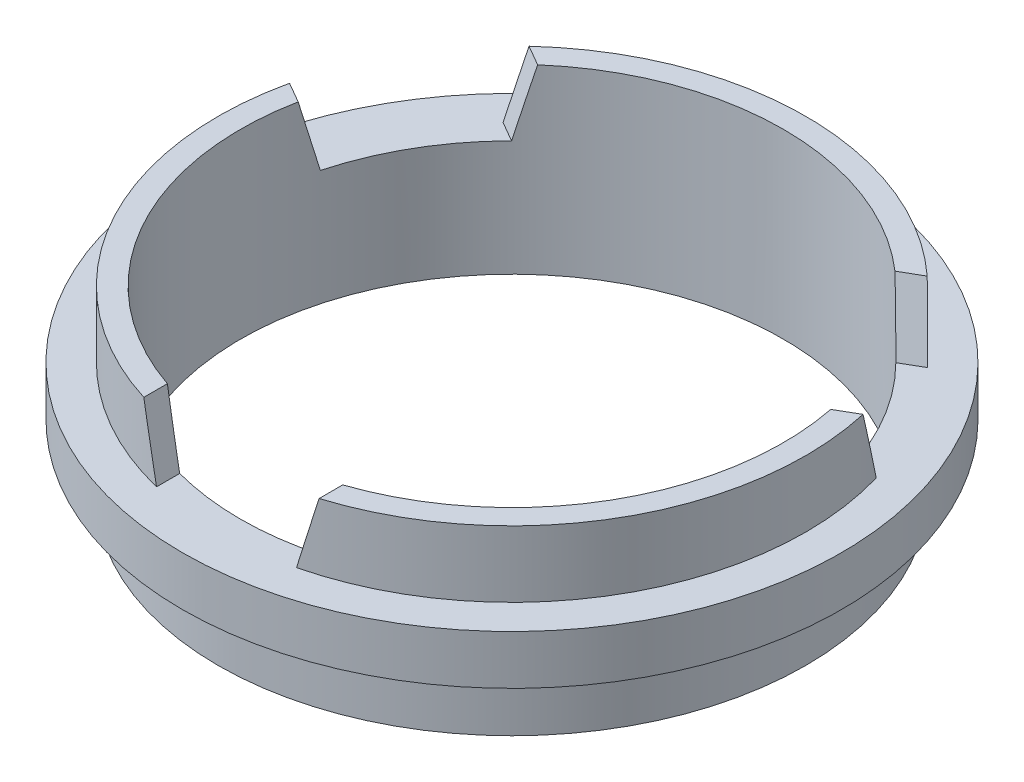
ISO-10303-21;
HEADER;
FILE_DESCRIPTION(('STEP AP214'),'2;1');
FILE_NAME('part.step','',(''),(''),'','','');
FILE_SCHEMA(('AUTOMOTIVE_DESIGN { 1 0 10303 214 1 1 1 1 }'));
ENDSEC;
DATA;
#1=APPLICATION_CONTEXT('core data for automotive mechanical design processes');
#2=APPLICATION_PROTOCOL_DEFINITION('international standard','automotive_design',2000,#1);
#3=PRODUCT_CONTEXT('',#1,'mechanical');
#4=PRODUCT('Part','Part','',(#3));
#5=PRODUCT_RELATED_PRODUCT_CATEGORY('part','',(#4));
#6=PRODUCT_DEFINITION_FORMATION('','',#4);
#7=PRODUCT_DEFINITION_CONTEXT('part definition',#1,'design');
#8=PRODUCT_DEFINITION('design','',#6,#7);
#9=PRODUCT_DEFINITION_SHAPE('','',#8);
#10=(LENGTH_UNIT() NAMED_UNIT(*) SI_UNIT(.MILLI.,.METRE.));
#11=(NAMED_UNIT(*) PLANE_ANGLE_UNIT() SI_UNIT($,.RADIAN.));
#12=(NAMED_UNIT(*) SI_UNIT($,.STERADIAN.) SOLID_ANGLE_UNIT());
#13=UNCERTAINTY_MEASURE_WITH_UNIT(LENGTH_MEASURE(1.E-05),#10,'distance_accuracy_value','');
#14=(GEOMETRIC_REPRESENTATION_CONTEXT(3) GLOBAL_UNCERTAINTY_ASSIGNED_CONTEXT((#13)) GLOBAL_UNIT_ASSIGNED_CONTEXT((#10,
#11,#12)) REPRESENTATION_CONTEXT('',''));
#15=CARTESIAN_POINT('',(0.,0.,0.));
#16=DIRECTION('',(0.,0.,1.));
#17=DIRECTION('',(1.,0.,0.));
#18=AXIS2_PLACEMENT_3D('',#15,#16,#17);
#19=CARTESIAN_POINT('',(0.,3.4,0.));
#20=DIRECTION('',(0.,1.,0.));
#21=DIRECTION('',(0.,0.,1.));
#22=AXIS2_PLACEMENT_3D('',#19,#20,#21);
#23=CYLINDRICAL_SURFACE('',#22,8.65);
#24=CARTESIAN_POINT('',(0.,5.35,0.));
#25=DIRECTION('',(0.,1.,0.));
#26=DIRECTION('',(0.,0.,1.));
#27=AXIS2_PLACEMENT_3D('',#24,#25,#26);
#28=CIRCLE('',#27,8.65);
#29=CARTESIAN_POINT('',(5.8601451034227,5.35,-6.36248374196988));
#30=VERTEX_POINT('',#29);
#31=CARTESIAN_POINT('',(-5.86014510342279,5.35,-6.36248374196979));
#32=VERTEX_POINT('',#31);
#33=EDGE_CURVE('E171',#30,#32,#28,.T.);
#34=ORIENTED_EDGE('',*,*,#33,.F.);
#35=CARTESIAN_POINT('',(0.,-4.325,0.));
#36=DIRECTION('',(0.483117469800627,0.257662650560332,0.8367840037188));
#37=DIRECTION('',(-0.128831325280167,0.966234939601246,-0.22314240099168));
#38=AXIS2_PLACEMENT_3D('',#35,#36,#37);
#39=ELLIPSE('',#38,33.5710277806623,8.65);
#40=CARTESIAN_POINT('',(6.24558760513538,3.4,-5.98457479413361));
#41=VERTEX_POINT('',#40);
#42=EDGE_CURVE('E379',#30,#41,#39,.F.);
#43=ORIENTED_EDGE('',*,*,#42,.T.);
#44=CARTESIAN_POINT('',(0.,3.4,0.));
#45=DIRECTION('',(0.,1.,0.));
#46=DIRECTION('',(0.,0.,1.));
#47=AXIS2_PLACEMENT_3D('',#44,#45,#46);
#48=CIRCLE('',#47,8.65);
#49=CARTESIAN_POINT('',(0.,3.4,-8.65));
#50=VERTEX_POINT('',#49);
#51=EDGE_CURVE('E185',#41,#50,#48,.T.);
#52=ORIENTED_EDGE('',*,*,#51,.T.);
#53=CARTESIAN_POINT('',(-6.24558760513547,3.4,-5.98457479413352));
#54=VERTEX_POINT('',#53);
#55=EDGE_CURVE('E199',#50,#54,#48,.T.);
#56=ORIENTED_EDGE('',*,*,#55,.T.);
#57=CARTESIAN_POINT('',(0.,-4.325,0.));
#58=DIRECTION('',(-0.483117469800615,0.257662650560332,0.836784003718806));
#59=DIRECTION('',(0.128831325280164,0.966234939601246,-0.223142400991682));
#60=AXIS2_PLACEMENT_3D('',#57,#58,#59);
#61=ELLIPSE('',#60,33.5710277806623,8.65);
#62=EDGE_CURVE('E367',#54,#32,#61,.F.);
#63=ORIENTED_EDGE('',*,*,#62,.T.);
#64=EDGE_LOOP('',(#34,#43,#52,#56,#63));
#65=FACE_BOUND('',#64,.T.);
#66=ADVANCED_FACE('F39',(#65),#23,.T.);
#67=CARTESIAN_POINT('',(2.06,3.4,8.40112492467527));
#68=VERTEX_POINT('',#67);
#69=CARTESIAN_POINT('',(8.3055876051354,3.4,-2.41655013054173));
#70=VERTEX_POINT('',#69);
#71=EDGE_CURVE('E191',#68,#70,#48,.T.);
#72=ORIENTED_EDGE('',*,*,#71,.T.);
#73=CARTESIAN_POINT('',(0.,-4.325,0.));
#74=DIRECTION('',(-0.483117469800627,0.257662650560332,-0.8367840037188));
#75=DIRECTION('',(0.128831325280167,0.966234939601246,0.22314240099168));
#76=AXIS2_PLACEMENT_3D('',#73,#74,#75);
#77=ELLIPSE('',#76,33.5710277806623,8.65);
#78=CARTESIAN_POINT('',(8.44014510342272,5.35,-1.89379265844218));
#79=VERTEX_POINT('',#78);
#80=EDGE_CURVE('E373',#70,#79,#77,.F.);
#81=ORIENTED_EDGE('',*,*,#80,.T.);
#82=CARTESIAN_POINT('',(2.58,5.35,8.25627640041199));
#83=VERTEX_POINT('',#82);
#84=EDGE_CURVE('E174',#83,#79,#28,.T.);
#85=ORIENTED_EDGE('',*,*,#84,.F.);
#86=CARTESIAN_POINT('',(0.,-4.325,0.));
#87=DIRECTION('',(-0.966234939601246,0.257662650560332,0.));
#88=DIRECTION('',(0.257662650560332,0.966234939601246,0.));
#89=AXIS2_PLACEMENT_3D('',#86,#87,#88);
#90=ELLIPSE('',#89,33.5710277806623,8.65);
#91=EDGE_CURVE('E239',#83,#68,#90,.F.);
#92=ORIENTED_EDGE('',*,*,#91,.T.);
#93=EDGE_LOOP('',(#72,#81,#85,#92));
#94=FACE_BOUND('',#93,.T.);
#95=ADVANCED_FACE('F299',(#94),#23,.T.);
#96=CARTESIAN_POINT('',(-8.44014510342275,5.35,-1.89379265844207));
#97=VERTEX_POINT('',#96);
#98=CARTESIAN_POINT('',(-2.58,5.35,8.25627640041199));
#99=VERTEX_POINT('',#98);
#100=EDGE_CURVE('E160',#97,#99,#28,.T.);
#101=ORIENTED_EDGE('',*,*,#100,.F.);
#102=CARTESIAN_POINT('',(0.,-4.325,0.));
#103=DIRECTION('',(0.483117469800615,0.257662650560332,-0.836784003718806));
#104=DIRECTION('',(-0.128831325280164,0.966234939601246,0.223142400991682));
#105=AXIS2_PLACEMENT_3D('',#102,#103,#104);
#106=ELLIPSE('',#105,33.5710277806623,8.65);
#107=CARTESIAN_POINT('',(-8.30558760513543,3.4,-2.41655013054161));
#108=VERTEX_POINT('',#107);
#109=EDGE_CURVE('E145',#97,#108,#106,.F.);
#110=ORIENTED_EDGE('',*,*,#109,.T.);
#111=CARTESIAN_POINT('',(-2.06,3.4,8.40112492467527));
#112=VERTEX_POINT('',#111);
#113=EDGE_CURVE('E192',#108,#112,#48,.T.);
#114=ORIENTED_EDGE('',*,*,#113,.T.);
#115=CARTESIAN_POINT('',(0.,-4.325,0.));
#116=DIRECTION('',(0.966234939601246,0.257662650560332,0.));
#117=DIRECTION('',(-0.257662650560332,0.966234939601246,0.));
#118=AXIS2_PLACEMENT_3D('',#115,#116,#117);
#119=ELLIPSE('',#118,33.5710277806623,8.65);
#120=EDGE_CURVE('E169',#112,#99,#119,.F.);
#121=ORIENTED_EDGE('',*,*,#120,.T.);
#122=EDGE_LOOP('',(#101,#110,#114,#121));
#123=FACE_BOUND('',#122,.T.);
#124=ADVANCED_FACE('F167',(#123),#23,.T.);
#125=CARTESIAN_POINT('',(0.,5.35,0.));
#126=DIRECTION('',(0.,1.,0.));
#127=DIRECTION('',(0.,0.,1.));
#128=AXIS2_PLACEMENT_3D('',#125,#126,#127);
#129=PLANE('',#128);
#130=CARTESIAN_POINT('',(0.,5.35,0.));
#131=DIRECTION('',(0.,1.,0.));
#132=DIRECTION('',(0.,0.,1.));
#133=AXIS2_PLACEMENT_3D('',#130,#131,#132);
#134=CIRCLE('',#133,7.99);
#135=CARTESIAN_POINT('',(5.25887585773312,5.35,-6.01534078111555));
#136=VERTEX_POINT('',#135);
#137=CARTESIAN_POINT('',(-5.2588758577332,5.35,-6.01534078111548));
#138=VERTEX_POINT('',#137);
#139=EDGE_CURVE('E252',#136,#138,#134,.T.);
#140=ORIENTED_EDGE('',*,*,#139,.F.);
#141=DIRECTION('',(-0.866025403784436,0.,0.500000000000004));
#142=VECTOR('',#141,1.);
#143=CARTESIAN_POINT('',(10.1122721015218,5.35,-8.81745040895087));
#144=LINE('',#143,#142);
#145=EDGE_CURVE('E351',#30,#136,#144,.T.);
#146=ORIENTED_EDGE('',*,*,#145,.F.);
#147=ORIENTED_EDGE('',*,*,#33,.T.);
#148=DIRECTION('',(0.866025403784443,0.,0.499999999999992));
#149=VECTOR('',#148,1.);
#150=CARTESIAN_POINT('',(-10.1122721015218,5.35,-8.8174504089507));
#151=LINE('',#150,#149);
#152=EDGE_CURVE('E164',#32,#138,#151,.T.);
#153=ORIENTED_EDGE('',*,*,#152,.T.);
#154=EDGE_LOOP('',(#140,#146,#147,#153));
#155=FACE_BOUND('',#154,.T.);
#156=ADVANCED_FACE('F308',(#155),#129,.T.);
#157=ORIENTED_EDGE('',*,*,#84,.T.);
#158=DIRECTION('',(-0.866025403784436,0.,0.500000000000004));
#159=VECTOR('',#158,1.);
#160=CARTESIAN_POINT('',(12.6922721015218,5.35,-4.34875932542317));
#161=LINE('',#160,#159);
#162=CARTESIAN_POINT('',(7.83887585773313,5.35,-1.54664969758785));
#163=VERTEX_POINT('',#162);
#164=EDGE_CURVE('E347',#79,#163,#161,.T.);
#165=ORIENTED_EDGE('',*,*,#164,.T.);
#166=CARTESIAN_POINT('',(2.58,5.35,7.56199047870334));
#167=VERTEX_POINT('',#166);
#168=EDGE_CURVE('E248',#167,#163,#134,.T.);
#169=ORIENTED_EDGE('',*,*,#168,.F.);
#170=DIRECTION('',(0.,0.,-1.));
#171=VECTOR('',#170,1.);
#172=CARTESIAN_POINT('',(2.58,5.35,9.7));
#173=LINE('',#172,#171);
#174=EDGE_CURVE('E225',#83,#167,#173,.T.);
#175=ORIENTED_EDGE('',*,*,#174,.F.);
#176=EDGE_LOOP('',(#157,#165,#169,#175));
#177=FACE_BOUND('',#176,.T.);
#178=ADVANCED_FACE('F312',(#177),#129,.T.);
#179=CARTESIAN_POINT('',(-7.83887585773316,5.35,-1.54664969758775));
#180=VERTEX_POINT('',#179);
#181=CARTESIAN_POINT('',(-2.58,5.35,7.56199047870334));
#182=VERTEX_POINT('',#181);
#183=EDGE_CURVE('E162',#180,#182,#134,.T.);
#184=ORIENTED_EDGE('',*,*,#183,.F.);
#185=DIRECTION('',(0.866025403784443,0.,0.499999999999992));
#186=VECTOR('',#185,1.);
#187=CARTESIAN_POINT('',(-12.6922721015218,5.35,-4.34875932542297));
#188=LINE('',#187,#186);
#189=EDGE_CURVE('E63',#97,#180,#188,.T.);
#190=ORIENTED_EDGE('',*,*,#189,.F.);
#191=ORIENTED_EDGE('',*,*,#100,.T.);
#192=DIRECTION('',(0.,0.,-1.));
#193=VECTOR('',#192,1.);
#194=CARTESIAN_POINT('',(-2.58,5.35,9.7));
#195=LINE('',#194,#193);
#196=EDGE_CURVE('E219',#99,#182,#195,.T.);
#197=ORIENTED_EDGE('',*,*,#196,.T.);
#198=EDGE_LOOP('',(#184,#190,#191,#197));
#199=FACE_BOUND('',#198,.T.);
#200=ADVANCED_FACE('F158',(#199),#129,.T.);
#201=CARTESIAN_POINT('',(0.,0.,0.));
#202=DIRECTION('',(0.,1.,0.));
#203=DIRECTION('',(0.,0.,1.));
#204=AXIS2_PLACEMENT_3D('',#201,#202,#203);
#205=CYLINDRICAL_SURFACE('',#204,7.99);
#206=CARTESIAN_POINT('',(0.,0.,0.));
#207=DIRECTION('',(0.,1.,0.));
#208=DIRECTION('',(0.,0.,1.));
#209=AXIS2_PLACEMENT_3D('',#206,#207,#208);
#210=CIRCLE('',#209,7.99);
#211=CARTESIAN_POINT('',(0.,0.,7.99));
#212=VERTEX_POINT('',#211);
#213=EDGE_CURVE('E243',#212,#212,#210,.T.);
#214=ORIENTED_EDGE('',*,*,#213,.F.);
#215=EDGE_LOOP('',(#214));
#216=FACE_BOUND('',#215,.T.);
#217=CARTESIAN_POINT('',(0.,-4.325,0.));
#218=DIRECTION('',(0.483117469800627,0.257662650560332,0.8367840037188));
#219=DIRECTION('',(-0.128831325280167,0.966234939601246,-0.22314240099168));
#220=AXIS2_PLACEMENT_3D('',#217,#218,#219);
#221=ELLIPSE('',#220,31.0095389557794,7.99);
#222=CARTESIAN_POINT('',(5.65560954588283,3.4,-5.64395080280817));
#223=VERTEX_POINT('',#222);
#224=EDGE_CURVE('E376',#136,#223,#221,.F.);
#225=ORIENTED_EDGE('',*,*,#224,.F.);
#226=ORIENTED_EDGE('',*,*,#139,.T.);
#227=CARTESIAN_POINT('',(0.,-4.325,0.));
#228=DIRECTION('',(-0.483117469800615,0.257662650560332,0.836784003718806));
#229=DIRECTION('',(0.128831325280164,0.966234939601246,-0.223142400991682));
#230=AXIS2_PLACEMENT_3D('',#227,#228,#229);
#231=ELLIPSE('',#230,31.0095389557794,7.99);
#232=CARTESIAN_POINT('',(-5.65560954588292,3.4,-5.64395080280809));
#233=VERTEX_POINT('',#232);
#234=EDGE_CURVE('E153',#233,#138,#231,.F.);
#235=ORIENTED_EDGE('',*,*,#234,.F.);
#236=CARTESIAN_POINT('',(0.,3.4,0.));
#237=DIRECTION('',(0.,1.,0.));
#238=DIRECTION('',(0.,0.,1.));
#239=AXIS2_PLACEMENT_3D('',#236,#237,#238);
#240=CIRCLE('',#239,7.99);
#241=CARTESIAN_POINT('',(-7.71560954588288,3.4,-2.07592613921619));
#242=VERTEX_POINT('',#241);
#243=EDGE_CURVE('E231',#242,#233,#240,.F.);
#244=ORIENTED_EDGE('',*,*,#243,.F.);
#245=CARTESIAN_POINT('',(0.,-4.325,0.));
#246=DIRECTION('',(0.483117469800615,0.257662650560332,-0.836784003718806));
#247=DIRECTION('',(-0.128831325280164,0.966234939601246,0.223142400991682));
#248=AXIS2_PLACEMENT_3D('',#245,#246,#247);
#249=ELLIPSE('',#248,31.0095389557794,7.99);
#250=EDGE_CURVE('E154',#180,#242,#249,.F.);
#251=ORIENTED_EDGE('',*,*,#250,.F.);
#252=ORIENTED_EDGE('',*,*,#183,.T.);
#253=CARTESIAN_POINT('',(0.,-4.325,0.));
#254=DIRECTION('',(0.966234939601246,0.257662650560332,0.));
#255=DIRECTION('',(-0.257662650560332,0.966234939601246,0.));
#256=AXIS2_PLACEMENT_3D('',#253,#254,#255);
#257=ELLIPSE('',#256,31.0095389557794,7.99);
#258=CARTESIAN_POINT('',(-2.06,3.4,7.7198769420244));
#259=VERTEX_POINT('',#258);
#260=EDGE_CURVE('E48',#259,#182,#257,.F.);
#261=ORIENTED_EDGE('',*,*,#260,.F.);
#262=CARTESIAN_POINT('',(0.,3.4,0.));
#263=DIRECTION('',(0.,1.,0.));
#264=DIRECTION('',(0.,0.,1.));
#265=AXIS2_PLACEMENT_3D('',#262,#263,#264);
#266=CIRCLE('',#265,7.99);
#267=CARTESIAN_POINT('',(2.06,3.4,7.7198769420244));
#268=VERTEX_POINT('',#267);
#269=EDGE_CURVE('E206',#268,#259,#266,.F.);
#270=ORIENTED_EDGE('',*,*,#269,.F.);
#271=CARTESIAN_POINT('',(0.,-4.325,0.));
#272=DIRECTION('',(-0.966234939601246,0.257662650560332,0.));
#273=DIRECTION('',(0.257662650560332,0.966234939601246,0.));
#274=AXIS2_PLACEMENT_3D('',#271,#272,#273);
#275=ELLIPSE('',#274,31.0095389557794,7.99);
#276=EDGE_CURVE('E11',#167,#268,#275,.F.);
#277=ORIENTED_EDGE('',*,*,#276,.F.);
#278=ORIENTED_EDGE('',*,*,#168,.T.);
#279=CARTESIAN_POINT('',(0.,-4.325,0.));
#280=DIRECTION('',(-0.483117469800627,0.257662650560332,-0.8367840037188));
#281=DIRECTION('',(0.128831325280167,0.966234939601246,0.22314240099168));
#282=AXIS2_PLACEMENT_3D('',#279,#280,#281);
#283=ELLIPSE('',#282,31.0095389557794,7.99);
#284=CARTESIAN_POINT('',(7.71560954588285,3.4,-2.07592613921629));
#285=VERTEX_POINT('',#284);
#286=EDGE_CURVE('E370',#285,#163,#283,.F.);
#287=ORIENTED_EDGE('',*,*,#286,.F.);
#288=EDGE_CURVE('E381',#223,#285,#240,.F.);
#289=ORIENTED_EDGE('',*,*,#288,.F.);
#290=EDGE_LOOP('',(#225,#226,#235,#244,#251,#252,#261,#270,#277,#278,#287,#289));
#291=FACE_BOUND('',#290,.T.);
#292=ADVANCED_FACE('F320',(#216,#291),#205,.F.);
#293=CARTESIAN_POINT('',(0.,5.35,0.));
#294=DIRECTION('',(0.,-1.,0.));
#295=DIRECTION('',(0.,0.,-1.));
#296=AXIS2_PLACEMENT_3D('',#293,#294,#295);
#297=CYLINDRICAL_SURFACE('',#296,9.7);
#298=DIRECTION('',(0.,-1.,0.));
#299=VECTOR('',#298,1.);
#300=CARTESIAN_POINT('',(1.8,38.3406304500935,-9.53152663532972));
#301=LINE('',#300,#299);
#302=CARTESIAN_POINT('',(1.8,3.4,-9.53152663532972));
#303=VERTEX_POINT('',#302);
#304=CARTESIAN_POINT('',(1.8,1.95,-9.53152663532972));
#305=VERTEX_POINT('',#304);
#306=EDGE_CURVE('E247',#303,#305,#301,.T.);
#307=ORIENTED_EDGE('',*,*,#306,.F.);
#308=CARTESIAN_POINT('',(0.,3.4,0.));
#309=DIRECTION('',(0.,1.,0.));
#310=DIRECTION('',(0.,0.,1.));
#311=AXIS2_PLACEMENT_3D('',#308,#309,#310);
#312=CIRCLE('',#311,9.7);
#313=CARTESIAN_POINT('',(-1.8,3.4,-9.53152663532972));
#314=VERTEX_POINT('',#313);
#315=EDGE_CURVE('E202',#314,#303,#312,.T.);
#316=ORIENTED_EDGE('',*,*,#315,.F.);
#317=DIRECTION('',(0.,-1.,0.));
#318=VECTOR('',#317,1.);
#319=CARTESIAN_POINT('',(-1.8,38.3406304500935,-9.53152663532972));
#320=LINE('',#319,#318);
#321=CARTESIAN_POINT('',(-1.8,1.95,-9.53152663532972));
#322=VERTEX_POINT('',#321);
#323=EDGE_CURVE('E255',#314,#322,#320,.T.);
#324=ORIENTED_EDGE('',*,*,#323,.T.);
#325=CARTESIAN_POINT('',(0.,1.95,0.));
#326=DIRECTION('',(0.,-1.,0.));
#327=DIRECTION('',(0.,0.,-1.));
#328=AXIS2_PLACEMENT_3D('',#325,#326,#327);
#329=CIRCLE('',#328,9.7);
#330=EDGE_CURVE('E172',#305,#322,#329,.T.);
#331=ORIENTED_EDGE('',*,*,#330,.F.);
#332=EDGE_LOOP('',(#307,#316,#324,#331));
#333=FACE_BOUND('',#332,.T.);
#334=ADVANCED_FACE('F41',(#333),#297,.T.);
#335=CARTESIAN_POINT('',(0.,3.4,0.));
#336=DIRECTION('',(0.,1.,0.));
#337=DIRECTION('',(0.,0.,1.));
#338=AXIS2_PLACEMENT_3D('',#335,#336,#337);
#339=PLANE('',#338);
#340=ORIENTED_EDGE('',*,*,#113,.F.);
#341=DIRECTION('',(0.866025403784443,0.,0.499999999999992));
#342=VECTOR('',#341,1.);
#343=CARTESIAN_POINT('',(-12.4322721015218,3.4,-4.79909253539088));
#344=LINE('',#343,#342);
#345=EDGE_CURVE('E148',#108,#242,#344,.T.);
#346=ORIENTED_EDGE('',*,*,#345,.T.);
#347=ORIENTED_EDGE('',*,*,#243,.T.);
#348=DIRECTION('',(0.866025403784443,0.,0.499999999999992));
#349=VECTOR('',#348,1.);
#350=CARTESIAN_POINT('',(-10.3722721015218,3.4,-8.36711719898279));
#351=LINE('',#350,#349);
#352=EDGE_CURVE('E389',#54,#233,#351,.T.);
#353=ORIENTED_EDGE('',*,*,#352,.F.);
#354=ORIENTED_EDGE('',*,*,#55,.F.);
#355=CARTESIAN_POINT('',(0.,3.4,-10.9284843065424));
#356=DIRECTION('',(0.,1.,0.));
#357=DIRECTION('',(0.,0.,1.));
#358=AXIS2_PLACEMENT_3D('',#355,#356,#357);
#359=CIRCLE('',#358,2.27848430654237);
#360=EDGE_CURVE('E260',#314,#50,#359,.T.);
#361=ORIENTED_EDGE('',*,*,#360,.F.);
#362=ORIENTED_EDGE('',*,*,#315,.T.);
#363=EDGE_CURVE('E259',#50,#303,#359,.T.);
#364=ORIENTED_EDGE('',*,*,#363,.F.);
#365=ORIENTED_EDGE('',*,*,#51,.F.);
#366=DIRECTION('',(-0.866025403784436,0.,0.500000000000004));
#367=VECTOR('',#366,1.);
#368=CARTESIAN_POINT('',(10.3722721015218,3.4,-8.36711719898296));
#369=LINE('',#368,#367);
#370=EDGE_CURVE('E55',#41,#223,#369,.T.);
#371=ORIENTED_EDGE('',*,*,#370,.T.);
#372=ORIENTED_EDGE('',*,*,#288,.T.);
#373=DIRECTION('',(-0.866025403784436,0.,0.500000000000004));
#374=VECTOR('',#373,1.);
#375=CARTESIAN_POINT('',(12.4322721015218,3.4,-4.79909253539108));
#376=LINE('',#375,#374);
#377=EDGE_CURVE('E352',#70,#285,#376,.T.);
#378=ORIENTED_EDGE('',*,*,#377,.F.);
#379=ORIENTED_EDGE('',*,*,#71,.F.);
#380=DIRECTION('',(0.,0.,-1.));
#381=VECTOR('',#380,1.);
#382=CARTESIAN_POINT('',(2.06,3.4,9.7));
#383=LINE('',#382,#381);
#384=EDGE_CURVE('E229',#68,#268,#383,.T.);
#385=ORIENTED_EDGE('',*,*,#384,.T.);
#386=ORIENTED_EDGE('',*,*,#269,.T.);
#387=DIRECTION('',(0.,0.,-1.));
#388=VECTOR('',#387,1.);
#389=CARTESIAN_POINT('',(-2.06,3.4,9.7));
#390=LINE('',#389,#388);
#391=EDGE_CURVE('E221',#112,#259,#390,.T.);
#392=ORIENTED_EDGE('',*,*,#391,.F.);
#393=EDGE_LOOP('',(#340,#346,#347,#353,#354,#361,#362,#364,#365,#371,#372,#378,#379,#385,#386,#392));
#394=FACE_BOUND('',#393,.T.);
#395=ADVANCED_FACE('F295',(#394),#339,.T.);
#396=CARTESIAN_POINT('',(0.,1.95,0.));
#397=DIRECTION('',(0.,-1.,0.));
#398=DIRECTION('',(0.,0.,-1.));
#399=AXIS2_PLACEMENT_3D('',#396,#397,#398);
#400=PLANE('',#399);
#401=ORIENTED_EDGE('',*,*,#330,.T.);
#402=CARTESIAN_POINT('',(0.,1.95,-10.9284843065424));
#403=DIRECTION('',(0.,-1.,0.));
#404=DIRECTION('',(0.,0.,-1.));
#405=AXIS2_PLACEMENT_3D('',#402,#403,#404);
#406=CIRCLE('',#405,2.27848430654237);
#407=CARTESIAN_POINT('',(0.,1.95,-8.65));
#408=VERTEX_POINT('',#407);
#409=EDGE_CURVE('E267',#322,#408,#406,.F.);
#410=ORIENTED_EDGE('',*,*,#409,.T.);
#411=CARTESIAN_POINT('',(0.,1.95,0.));
#412=DIRECTION('',(0.,-1.,0.));
#413=DIRECTION('',(0.,0.,-1.));
#414=AXIS2_PLACEMENT_3D('',#411,#412,#413);
#415=CIRCLE('',#414,8.65);
#416=EDGE_CURVE('E179',#408,#408,#415,.T.);
#417=ORIENTED_EDGE('',*,*,#416,.F.);
#418=EDGE_CURVE('E263',#408,#305,#406,.F.);
#419=ORIENTED_EDGE('',*,*,#418,.T.);
#420=EDGE_LOOP('',(#401,#410,#417,#419));
#421=FACE_BOUND('',#420,.T.);
#422=ADVANCED_FACE('F280',(#421),#400,.T.);
#423=CARTESIAN_POINT('',(0.,1.95,0.));
#424=DIRECTION('',(0.,-1.,0.));
#425=DIRECTION('',(0.,0.,-1.));
#426=AXIS2_PLACEMENT_3D('',#423,#424,#425);
#427=CYLINDRICAL_SURFACE('',#426,8.65);
#428=ORIENTED_EDGE('',*,*,#416,.T.);
#429=EDGE_LOOP('',(#428));
#430=FACE_BOUND('',#429,.T.);
#431=CARTESIAN_POINT('',(0.,0.,0.));
#432=DIRECTION('',(0.,-1.,0.));
#433=DIRECTION('',(0.,0.,-1.));
#434=AXIS2_PLACEMENT_3D('',#431,#432,#433);
#435=CIRCLE('',#434,8.65);
#436=CARTESIAN_POINT('',(0.,0.,-8.65));
#437=VERTEX_POINT('',#436);
#438=EDGE_CURVE('E271',#437,#437,#435,.T.);
#439=ORIENTED_EDGE('',*,*,#438,.F.);
#440=EDGE_LOOP('',(#439));
#441=FACE_BOUND('',#440,.T.);
#442=ADVANCED_FACE('F284',(#430,#441),#427,.T.);
#443=CARTESIAN_POINT('',(0.,0.,0.));
#444=DIRECTION('',(0.,1.,0.));
#445=DIRECTION('',(0.,0.,1.));
#446=AXIS2_PLACEMENT_3D('',#443,#444,#445);
#447=PLANE('',#446);
#448=ORIENTED_EDGE('',*,*,#213,.T.);
#449=EDGE_LOOP('',(#448));
#450=FACE_BOUND('',#449,.T.);
#451=ORIENTED_EDGE('',*,*,#438,.T.);
#452=EDGE_LOOP('',(#451));
#453=FACE_BOUND('',#452,.T.);
#454=ADVANCED_FACE('F287',(#450,#453),#447,.F.);
#455=CARTESIAN_POINT('',(0.,38.3406304500935,-10.9284843065424));
#456=DIRECTION('',(0.,-1.,0.));
#457=DIRECTION('',(0.,0.,-1.));
#458=AXIS2_PLACEMENT_3D('',#455,#456,#457);
#459=CYLINDRICAL_SURFACE('',#458,2.27848430654237);
#460=ORIENTED_EDGE('',*,*,#409,.F.);
#461=ORIENTED_EDGE('',*,*,#323,.F.);
#462=ORIENTED_EDGE('',*,*,#360,.T.);
#463=ORIENTED_EDGE('',*,*,#363,.T.);
#464=ORIENTED_EDGE('',*,*,#306,.T.);
#465=ORIENTED_EDGE('',*,*,#418,.F.);
#466=EDGE_LOOP('',(#460,#461,#462,#463,#464,#465));
#467=FACE_BOUND('',#466,.T.);
#468=ADVANCED_FACE('F293',(#467),#459,.F.);
#469=CARTESIAN_POINT('',(2.06,3.4,9.7));
#470=DIRECTION('',(-0.966234939601246,0.257662650560332,0.));
#471=DIRECTION('',(-0.257662650560332,-0.966234939601246,0.));
#472=AXIS2_PLACEMENT_3D('',#469,#470,#471);
#473=PLANE('',#472);
#474=ORIENTED_EDGE('',*,*,#174,.T.);
#475=ORIENTED_EDGE('',*,*,#276,.T.);
#476=ORIENTED_EDGE('',*,*,#384,.F.);
#477=ORIENTED_EDGE('',*,*,#91,.F.);
#478=EDGE_LOOP('',(#474,#475,#476,#477));
#479=FACE_BOUND('',#478,.T.);
#480=ADVANCED_FACE('F332',(#479),#473,.T.);
#481=CARTESIAN_POINT('',(-2.06,3.4,9.7));
#482=DIRECTION('',(0.966234939601246,0.257662650560332,0.));
#483=DIRECTION('',(-0.257662650560332,0.966234939601246,0.));
#484=AXIS2_PLACEMENT_3D('',#481,#482,#483);
#485=PLANE('',#484);
#486=ORIENTED_EDGE('',*,*,#391,.T.);
#487=ORIENTED_EDGE('',*,*,#260,.T.);
#488=ORIENTED_EDGE('',*,*,#196,.F.);
#489=ORIENTED_EDGE('',*,*,#120,.F.);
#490=EDGE_LOOP('',(#486,#487,#488,#489));
#491=FACE_BOUND('',#490,.T.);
#492=ADVANCED_FACE('F218',(#491),#485,.T.);
#493=CARTESIAN_POINT('',(-10.3722721015218,3.4,-8.36711719898279));
#494=DIRECTION('',(-0.483117469800615,0.257662650560332,0.836784003718806));
#495=DIRECTION('',(0.866025403784443,0.,0.499999999999992));
#496=AXIS2_PLACEMENT_3D('',#493,#494,#495);
#497=PLANE('',#496);
#498=ORIENTED_EDGE('',*,*,#352,.T.);
#499=ORIENTED_EDGE('',*,*,#234,.T.);
#500=ORIENTED_EDGE('',*,*,#152,.F.);
#501=ORIENTED_EDGE('',*,*,#62,.F.);
#502=EDGE_LOOP('',(#498,#499,#500,#501));
#503=FACE_BOUND('',#502,.T.);
#504=ADVANCED_FACE('F342',(#503),#497,.T.);
#505=CARTESIAN_POINT('',(-12.4322721015218,3.4,-4.79909253539088));
#506=DIRECTION('',(0.483117469800615,0.257662650560332,-0.836784003718806));
#507=DIRECTION('',(-0.866025403784443,0.,-0.499999999999992));
#508=AXIS2_PLACEMENT_3D('',#505,#506,#507);
#509=PLANE('',#508);
#510=ORIENTED_EDGE('',*,*,#189,.T.);
#511=ORIENTED_EDGE('',*,*,#250,.T.);
#512=ORIENTED_EDGE('',*,*,#345,.F.);
#513=ORIENTED_EDGE('',*,*,#109,.F.);
#514=EDGE_LOOP('',(#510,#511,#512,#513));
#515=FACE_BOUND('',#514,.T.);
#516=ADVANCED_FACE('F146',(#515),#509,.T.);
#517=CARTESIAN_POINT('',(10.3722721015218,3.4,-8.36711719898296));
#518=DIRECTION('',(0.483117469800627,0.257662650560332,0.8367840037188));
#519=DIRECTION('',(0.866025403784436,0.,-0.500000000000004));
#520=AXIS2_PLACEMENT_3D('',#517,#518,#519);
#521=PLANE('',#520);
#522=ORIENTED_EDGE('',*,*,#145,.T.);
#523=ORIENTED_EDGE('',*,*,#224,.T.);
#524=ORIENTED_EDGE('',*,*,#370,.F.);
#525=ORIENTED_EDGE('',*,*,#42,.F.);
#526=EDGE_LOOP('',(#522,#523,#524,#525));
#527=FACE_BOUND('',#526,.T.);
#528=ADVANCED_FACE('F405',(#527),#521,.T.);
#529=CARTESIAN_POINT('',(12.4322721015218,3.4,-4.79909253539108));
#530=DIRECTION('',(-0.483117469800627,0.257662650560332,-0.8367840037188));
#531=DIRECTION('',(-0.866025403784436,0.,0.500000000000004));
#532=AXIS2_PLACEMENT_3D('',#529,#530,#531);
#533=PLANE('',#532);
#534=ORIENTED_EDGE('',*,*,#377,.T.);
#535=ORIENTED_EDGE('',*,*,#286,.T.);
#536=ORIENTED_EDGE('',*,*,#164,.F.);
#537=ORIENTED_EDGE('',*,*,#80,.F.);
#538=EDGE_LOOP('',(#534,#535,#536,#537));
#539=FACE_BOUND('',#538,.T.);
#540=ADVANCED_FACE('F406',(#539),#533,.T.);
#541=CLOSED_SHELL('',(#66,#95,#124,#156,#178,#200,#292,#334,#395,#422,#442,#454,#468,#480,#492,
#504,#516,#528,#540));
#542=MANIFOLD_SOLID_BREP('B2',#541);
#543=ADVANCED_BREP_SHAPE_REPRESENTATION('',(#18,#542),#14);
#544=SHAPE_DEFINITION_REPRESENTATION(#9,#543);
ENDSEC;
END-ISO-10303-21;
